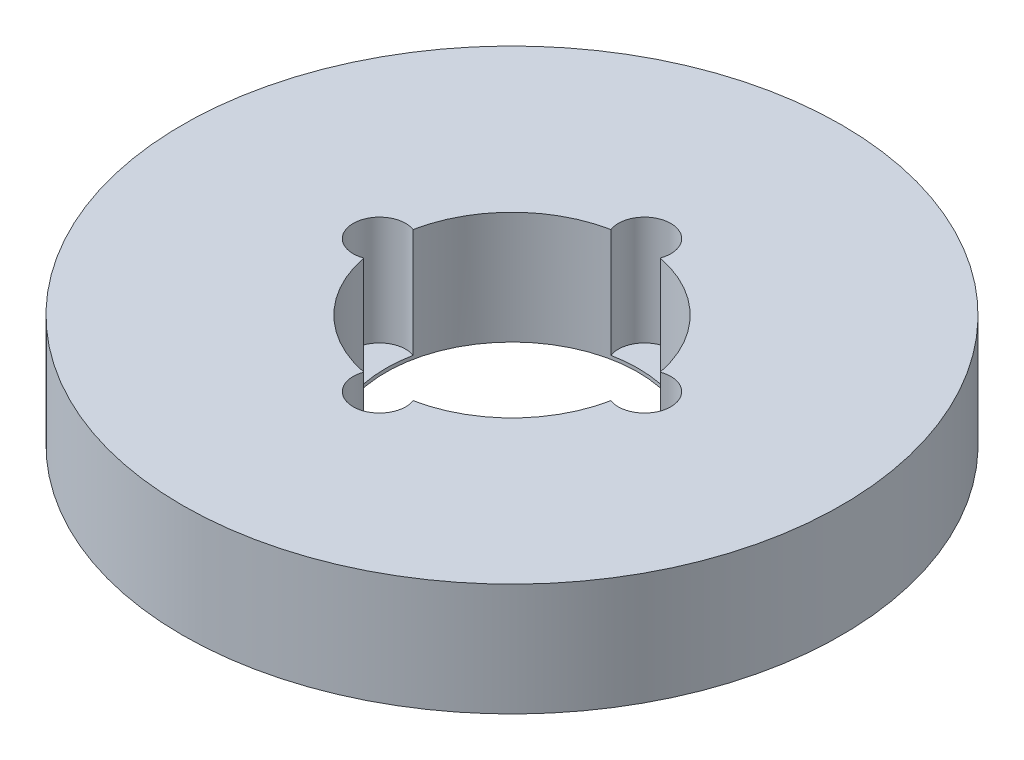
ISO-10303-21;
HEADER;
FILE_DESCRIPTION(('STEP AP214'),'2;1');
FILE_NAME('part.step','',(''),(''),'','','');
FILE_SCHEMA(('AUTOMOTIVE_DESIGN { 1 0 10303 214 1 1 1 1 }'));
ENDSEC;
DATA;
#1=APPLICATION_CONTEXT('core data for automotive mechanical design processes');
#2=APPLICATION_PROTOCOL_DEFINITION('international standard','automotive_design',2000,#1);
#3=PRODUCT_CONTEXT('',#1,'mechanical');
#4=PRODUCT('Part','Part','',(#3));
#5=PRODUCT_RELATED_PRODUCT_CATEGORY('part','',(#4));
#6=PRODUCT_DEFINITION_FORMATION('','',#4);
#7=PRODUCT_DEFINITION_CONTEXT('part definition',#1,'design');
#8=PRODUCT_DEFINITION('design','',#6,#7);
#9=PRODUCT_DEFINITION_SHAPE('','',#8);
#10=(LENGTH_UNIT() NAMED_UNIT(*) SI_UNIT(.MILLI.,.METRE.));
#11=(NAMED_UNIT(*) PLANE_ANGLE_UNIT() SI_UNIT($,.RADIAN.));
#12=(NAMED_UNIT(*) SI_UNIT($,.STERADIAN.) SOLID_ANGLE_UNIT());
#13=UNCERTAINTY_MEASURE_WITH_UNIT(LENGTH_MEASURE(1.E-05),#10,'distance_accuracy_value','');
#14=(GEOMETRIC_REPRESENTATION_CONTEXT(3) GLOBAL_UNCERTAINTY_ASSIGNED_CONTEXT((#13)) GLOBAL_UNIT_ASSIGNED_CONTEXT((#10,
#11,#12)) REPRESENTATION_CONTEXT('',''));
#15=CARTESIAN_POINT('',(0.,0.,0.));
#16=DIRECTION('',(0.,0.,1.));
#17=DIRECTION('',(1.,0.,0.));
#18=AXIS2_PLACEMENT_3D('',#15,#16,#17);
#19=CARTESIAN_POINT('',(0.,29.,0.));
#20=DIRECTION('',(0.,-1.,0.));
#21=DIRECTION('',(0.,0.,-1.));
#22=AXIS2_PLACEMENT_3D('',#19,#20,#21);
#23=CYLINDRICAL_SURFACE('',#22,85.);
#24=CARTESIAN_POINT('',(0.,29.,0.));
#25=DIRECTION('',(0.,1.,0.));
#26=DIRECTION('',(0.,0.,1.));
#27=AXIS2_PLACEMENT_3D('',#24,#25,#26);
#28=CIRCLE('',#27,85.);
#29=CARTESIAN_POINT('',(0.,29.,-85.));
#30=VERTEX_POINT('',#29);
#31=EDGE_CURVE('E145',#30,#30,#28,.T.);
#32=CARTESIAN_POINT('',(0.,0.,0.));
#33=DIRECTION('',(0.,1.,0.));
#34=DIRECTION('',(0.,0.,1.));
#35=AXIS2_PLACEMENT_3D('',#32,#33,#34);
#36=CIRCLE('',#35,85.);
#37=CARTESIAN_POINT('',(0.,0.,-85.));
#38=VERTEX_POINT('',#37);
#39=EDGE_CURVE('E143',#38,#38,#36,.T.);
#40=CARTESIAN_POINT('',(0.,29.,-85.));
#41=CARTESIAN_POINT('',(0.,28.6979166666667,-85.));
#42=CARTESIAN_POINT('',(0.,28.3958333333333,-85.));
#43=CARTESIAN_POINT('',(0.,27.7916666666667,-85.));
#44=CARTESIAN_POINT('',(0.,27.4895833333333,-85.));
#45=CARTESIAN_POINT('',(0.,26.8854166666667,-85.));
#46=CARTESIAN_POINT('',(0.,26.5833333333333,-85.));
#47=CARTESIAN_POINT('',(0.,25.9791666666667,-85.));
#48=CARTESIAN_POINT('',(0.,25.6770833333333,-85.));
#49=CARTESIAN_POINT('',(0.,25.0729166666667,-85.));
#50=CARTESIAN_POINT('',(0.,24.7708333333333,-85.));
#51=CARTESIAN_POINT('',(0.,24.1666666666667,-85.));
#52=CARTESIAN_POINT('',(0.,23.8645833333333,-85.));
#53=CARTESIAN_POINT('',(0.,23.2604166666667,-85.));
#54=CARTESIAN_POINT('',(0.,22.9583333333333,-85.));
#55=CARTESIAN_POINT('',(0.,22.3541666666667,-85.));
#56=CARTESIAN_POINT('',(0.,22.0520833333333,-85.));
#57=CARTESIAN_POINT('',(0.,21.4479166666667,-85.));
#58=CARTESIAN_POINT('',(0.,21.1458333333333,-85.));
#59=CARTESIAN_POINT('',(0.,20.5416666666667,-85.));
#60=CARTESIAN_POINT('',(0.,20.2395833333333,-85.));
#61=CARTESIAN_POINT('',(0.,19.6354166666667,-85.));
#62=CARTESIAN_POINT('',(0.,19.3333333333333,-85.));
#63=CARTESIAN_POINT('',(0.,18.7291666666667,-85.));
#64=CARTESIAN_POINT('',(0.,18.4270833333333,-85.));
#65=CARTESIAN_POINT('',(0.,17.8229166666667,-85.));
#66=CARTESIAN_POINT('',(0.,17.5208333333333,-85.));
#67=CARTESIAN_POINT('',(0.,16.9166666666667,-85.));
#68=CARTESIAN_POINT('',(0.,16.6145833333333,-85.));
#69=CARTESIAN_POINT('',(0.,16.0104166666667,-85.));
#70=CARTESIAN_POINT('',(0.,15.7083333333333,-85.));
#71=CARTESIAN_POINT('',(0.,15.1041666666667,-85.));
#72=CARTESIAN_POINT('',(0.,14.8020833333333,-85.));
#73=CARTESIAN_POINT('',(0.,14.1979166666667,-85.));
#74=CARTESIAN_POINT('',(0.,13.8958333333333,-85.));
#75=CARTESIAN_POINT('',(0.,13.2916666666667,-85.));
#76=CARTESIAN_POINT('',(0.,12.9895833333333,-85.));
#77=CARTESIAN_POINT('',(0.,12.3854166666667,-85.));
#78=CARTESIAN_POINT('',(0.,12.0833333333333,-85.));
#79=CARTESIAN_POINT('',(0.,11.4791666666667,-85.));
#80=CARTESIAN_POINT('',(0.,11.1770833333333,-85.));
#81=CARTESIAN_POINT('',(0.,10.5729166666667,-85.));
#82=CARTESIAN_POINT('',(0.,10.2708333333333,-85.));
#83=CARTESIAN_POINT('',(0.,9.66666666666667,-85.));
#84=CARTESIAN_POINT('',(0.,9.36458333333333,-85.));
#85=CARTESIAN_POINT('',(0.,8.76041666666667,-85.));
#86=CARTESIAN_POINT('',(0.,8.45833333333333,-85.));
#87=CARTESIAN_POINT('',(0.,7.85416666666667,-85.));
#88=CARTESIAN_POINT('',(0.,7.55208333333333,-85.));
#89=CARTESIAN_POINT('',(0.,6.94791666666667,-85.));
#90=CARTESIAN_POINT('',(0.,6.64583333333333,-85.));
#91=CARTESIAN_POINT('',(0.,6.04166666666667,-85.));
#92=CARTESIAN_POINT('',(0.,5.73958333333333,-85.));
#93=CARTESIAN_POINT('',(0.,5.13541666666667,-85.));
#94=CARTESIAN_POINT('',(0.,4.83333333333333,-85.));
#95=CARTESIAN_POINT('',(0.,4.22916666666667,-85.));
#96=CARTESIAN_POINT('',(0.,3.92708333333333,-85.));
#97=CARTESIAN_POINT('',(0.,3.32291666666667,-85.));
#98=CARTESIAN_POINT('',(0.,3.02083333333333,-85.));
#99=CARTESIAN_POINT('',(0.,2.41666666666667,-85.));
#100=CARTESIAN_POINT('',(0.,2.11458333333333,-85.));
#101=CARTESIAN_POINT('',(0.,1.51041666666667,-85.));
#102=CARTESIAN_POINT('',(0.,1.20833333333333,-85.));
#103=CARTESIAN_POINT('',(0.,0.604166666666667,-85.));
#104=CARTESIAN_POINT('',(0.,0.302083333333333,-85.));
#105=CARTESIAN_POINT('',(0.,0.,-85.));
#106=B_SPLINE_CURVE_WITH_KNOTS('',3,(#40,#41,#42,#43,#44,#45,#46,#47,#48,#49,#50,#51,#52,#53,
#54,#55,#56,#57,#58,#59,#60,#61,#62,#63,#64,#65,#66,#67,#68,#69,#70,#71,#72,#73,#74,#75,#76,#77,
#78,#79,#80,#81,#82,#83,#84,#85,#86,#87,#88,#89,#90,#91,#92,#93,#94,#95,#96,#97,#98,#99,#100,
#101,#102,#103,#104,#105),.UNSPECIFIED.,.F.,.F.,(4,2,2,2,2,2,2,2,2,2,2,2,2,2,2,2,2,2,2,2,2,2,2,
2,2,2,2,2,2,2,2,2,4),(0.,0.906249999999997,1.8125,2.71875,3.625,4.53125,5.4375,6.34375,7.25,
8.15625,9.0625,9.96875,10.875,11.78125,12.6875,13.59375,14.5,15.40625,16.3125,17.21875,18.125,
19.03125,19.9375,20.84375,21.75,22.65625,23.5625,24.46875,25.375,26.28125,27.1875,28.09375,29.),.UNSPECIFIED.);
#107=EDGE_CURVE('BSEAM39',#30,#38,#106,.T.);
#108=ORIENTED_EDGE('',*,*,#31,.F.);
#109=ORIENTED_EDGE('',*,*,#39,.T.);
#110=ORIENTED_EDGE('',*,*,#107,.T.);
#111=ORIENTED_EDGE('',*,*,#107,.F.);
#112=EDGE_LOOP('',(#108,#110,#109,#111));
#113=FACE_BOUND('',#112,.T.);
#114=ADVANCED_FACE('F39',(#113),#23,.T.);
#115=CARTESIAN_POINT('',(0.,29.,0.));
#116=DIRECTION('',(0.,1.,0.));
#117=DIRECTION('',(0.,0.,1.));
#118=AXIS2_PLACEMENT_3D('',#115,#116,#117);
#119=PLANE('',#118);
#120=CARTESIAN_POINT('',(1.19339958026891E-13,29.,34.1803224606188));
#121=DIRECTION('',(0.,1.,0.));
#122=DIRECTION('',(1.,0.,0.));
#123=AXIS2_PLACEMENT_3D('',#120,#121,#122);
#124=CIRCLE('',#123,6.78343065768431);
#125=CARTESIAN_POINT('',(-6.3772204408346,29.,31.8681825564151));
#126=VERTEX_POINT('',#125);
#127=CARTESIAN_POINT('',(6.37722044083483,29.,31.8681825564151));
#128=VERTEX_POINT('',#127);
#129=EDGE_CURVE('E152',#126,#128,#124,.T.);
#130=ORIENTED_EDGE('',*,*,#129,.F.);
#131=CARTESIAN_POINT('',(0.,29.,0.));
#132=DIRECTION('',(0.,1.,0.));
#133=DIRECTION('',(0.,0.,1.));
#134=AXIS2_PLACEMENT_3D('',#131,#132,#133);
#135=CIRCLE('',#134,32.5);
#136=CARTESIAN_POINT('',(-31.8681825564151,29.,6.37722044083472));
#137=VERTEX_POINT('',#136);
#138=EDGE_CURVE('E133',#137,#126,#135,.T.);
#139=ORIENTED_EDGE('',*,*,#138,.F.);
#140=CARTESIAN_POINT('',(-34.1803224606188,29.,0.));
#141=DIRECTION('',(0.,1.,0.));
#142=DIRECTION('',(0.,0.,1.));
#143=AXIS2_PLACEMENT_3D('',#140,#141,#142);
#144=CIRCLE('',#143,6.78343065768431);
#145=CARTESIAN_POINT('',(-31.8681825564151,29.,-6.37722044083472));
#146=VERTEX_POINT('',#145);
#147=EDGE_CURVE('E128',#146,#137,#144,.T.);
#148=ORIENTED_EDGE('',*,*,#147,.F.);
#149=CARTESIAN_POINT('',(-6.37722044083505,29.,-31.868182556415));
#150=VERTEX_POINT('',#149);
#151=EDGE_CURVE('E121',#150,#146,#135,.T.);
#152=ORIENTED_EDGE('',*,*,#151,.F.);
#153=CARTESIAN_POINT('',(-3.58019874080674E-13,29.,-34.1803224606188));
#154=DIRECTION('',(0.,1.,0.));
#155=DIRECTION('',(-1.,0.,0.));
#156=AXIS2_PLACEMENT_3D('',#153,#154,#155);
#157=CIRCLE('',#156,6.78343065768431);
#158=CARTESIAN_POINT('',(6.37722044083438,29.,-31.8681825564152));
#159=VERTEX_POINT('',#158);
#160=EDGE_CURVE('E105',#159,#150,#157,.T.);
#161=ORIENTED_EDGE('',*,*,#160,.F.);
#162=CARTESIAN_POINT('',(31.8681825564151,29.,-6.37722044083472));
#163=VERTEX_POINT('',#162);
#164=EDGE_CURVE('E131',#163,#159,#135,.T.);
#165=ORIENTED_EDGE('',*,*,#164,.F.);
#166=CARTESIAN_POINT('',(34.1803224606188,29.,0.));
#167=DIRECTION('',(0.,1.,0.));
#168=DIRECTION('',(0.,0.,-1.));
#169=AXIS2_PLACEMENT_3D('',#166,#167,#168);
#170=CIRCLE('',#169,6.78343065768431);
#171=CARTESIAN_POINT('',(31.8681825564151,29.,6.37722044083472));
#172=VERTEX_POINT('',#171);
#173=EDGE_CURVE('E154',#172,#163,#170,.T.);
#174=ORIENTED_EDGE('',*,*,#173,.F.);
#175=EDGE_CURVE('E134',#128,#172,#135,.T.);
#176=ORIENTED_EDGE('',*,*,#175,.F.);
#177=EDGE_LOOP('',(#130,#139,#148,#152,#161,#165,#174,#176));
#178=FACE_BOUND('',#177,.T.);
#179=ORIENTED_EDGE('',*,*,#31,.T.);
#180=EDGE_LOOP('',(#179));
#181=FACE_BOUND('',#180,.T.);
#182=ADVANCED_FACE('F130',(#178,#181),#119,.T.);
#183=CARTESIAN_POINT('',(0.,0.,0.));
#184=DIRECTION('',(0.,1.,0.));
#185=DIRECTION('',(0.,0.,1.));
#186=AXIS2_PLACEMENT_3D('',#183,#184,#185);
#187=PLANE('',#186);
#188=CARTESIAN_POINT('',(0.,0.,0.));
#189=DIRECTION('',(0.,1.,0.));
#190=DIRECTION('',(0.,0.,1.));
#191=AXIS2_PLACEMENT_3D('',#188,#189,#190);
#192=CIRCLE('',#191,32.5);
#193=CARTESIAN_POINT('',(0.,0.,32.5));
#194=VERTEX_POINT('',#193);
#195=EDGE_CURVE('E135',#194,#194,#192,.T.);
#196=ORIENTED_EDGE('',*,*,#195,.T.);
#197=EDGE_LOOP('',(#196));
#198=FACE_BOUND('',#197,.T.);
#199=ORIENTED_EDGE('',*,*,#39,.F.);
#200=EDGE_LOOP('',(#199));
#201=FACE_BOUND('',#200,.T.);
#202=ADVANCED_FACE('F195',(#198,#201),#187,.F.);
#203=CARTESIAN_POINT('',(0.,29.,0.));
#204=DIRECTION('',(0.,-1.,0.));
#205=DIRECTION('',(0.,0.,-1.));
#206=AXIS2_PLACEMENT_3D('',#203,#204,#205);
#207=CYLINDRICAL_SURFACE('',#206,32.5);
#208=DIRECTION('',(0.,1.,0.));
#209=VECTOR('',#208,1.);
#210=CARTESIAN_POINT('',(-6.3772204408346,14.9445900321365,31.8681825564151));
#211=LINE('',#210,#209);
#212=CARTESIAN_POINT('',(-6.3772204408346,0.889180064273069,31.8681825564151));
#213=VERTEX_POINT('',#212);
#214=EDGE_CURVE('E11',#213,#126,#211,.T.);
#215=ORIENTED_EDGE('',*,*,#214,.F.);
#216=CARTESIAN_POINT('',(0.,0.889180064273069,0.));
#217=DIRECTION('',(0.,1.,0.));
#218=DIRECTION('',(0.,0.,1.));
#219=AXIS2_PLACEMENT_3D('',#216,#217,#218);
#220=CIRCLE('',#219,32.5);
#221=CARTESIAN_POINT('',(6.37722044083483,0.889180064273069,31.8681825564151));
#222=VERTEX_POINT('',#221);
#223=EDGE_CURVE('E169',#213,#222,#220,.T.);
#224=ORIENTED_EDGE('',*,*,#223,.T.);
#225=DIRECTION('',(0.,1.,0.));
#226=VECTOR('',#225,1.);
#227=CARTESIAN_POINT('',(6.37722044083483,14.9445900321365,31.8681825564151));
#228=LINE('',#227,#226);
#229=EDGE_CURVE('E46',#128,#222,#228,.F.);
#230=ORIENTED_EDGE('',*,*,#229,.F.);
#231=ORIENTED_EDGE('',*,*,#175,.T.);
#232=DIRECTION('',(0.,1.,0.));
#233=VECTOR('',#232,1.);
#234=CARTESIAN_POINT('',(31.8681825564151,14.9445900321365,6.37722044083472));
#235=LINE('',#234,#233);
#236=CARTESIAN_POINT('',(31.8681825564151,0.889180064273069,6.37722044083472));
#237=VERTEX_POINT('',#236);
#238=EDGE_CURVE('E151',#237,#172,#235,.T.);
#239=ORIENTED_EDGE('',*,*,#238,.F.);
#240=CARTESIAN_POINT('',(0.,0.889180064273069,0.));
#241=DIRECTION('',(0.,1.,0.));
#242=DIRECTION('',(0.,0.,1.));
#243=AXIS2_PLACEMENT_3D('',#240,#241,#242);
#244=CIRCLE('',#243,32.5);
#245=CARTESIAN_POINT('',(31.8681825564151,0.889180064273069,-6.37722044083472));
#246=VERTEX_POINT('',#245);
#247=EDGE_CURVE('E173',#237,#246,#244,.T.);
#248=ORIENTED_EDGE('',*,*,#247,.T.);
#249=DIRECTION('',(0.,1.,0.));
#250=VECTOR('',#249,1.);
#251=CARTESIAN_POINT('',(31.8681825564151,14.9445900321365,-6.37722044083472));
#252=LINE('',#251,#250);
#253=EDGE_CURVE('E168',#163,#246,#252,.F.);
#254=ORIENTED_EDGE('',*,*,#253,.F.);
#255=ORIENTED_EDGE('',*,*,#164,.T.);
#256=DIRECTION('',(0.,1.,0.));
#257=VECTOR('',#256,1.);
#258=CARTESIAN_POINT('',(6.37722044083438,14.9445900321365,-31.8681825564152));
#259=LINE('',#258,#257);
#260=CARTESIAN_POINT('',(6.37722044083438,0.889180064273069,-31.8681825564152));
#261=VERTEX_POINT('',#260);
#262=EDGE_CURVE('E108',#261,#159,#259,.T.);
#263=ORIENTED_EDGE('',*,*,#262,.F.);
#264=CARTESIAN_POINT('',(0.,0.889180064273069,0.));
#265=DIRECTION('',(0.,1.,0.));
#266=DIRECTION('',(0.,0.,1.));
#267=AXIS2_PLACEMENT_3D('',#264,#265,#266);
#268=CIRCLE('',#267,32.5);
#269=CARTESIAN_POINT('',(-6.37722044083505,0.889180064273069,-31.868182556415));
#270=VERTEX_POINT('',#269);
#271=EDGE_CURVE('E122',#261,#270,#268,.T.);
#272=ORIENTED_EDGE('',*,*,#271,.T.);
#273=DIRECTION('',(0.,1.,0.));
#274=VECTOR('',#273,1.);
#275=CARTESIAN_POINT('',(-6.37722044083505,14.9445900321365,-31.868182556415));
#276=LINE('',#275,#274);
#277=EDGE_CURVE('E106',#150,#270,#276,.F.);
#278=ORIENTED_EDGE('',*,*,#277,.F.);
#279=ORIENTED_EDGE('',*,*,#151,.T.);
#280=DIRECTION('',(0.,1.,0.));
#281=VECTOR('',#280,1.);
#282=CARTESIAN_POINT('',(-31.8681825564151,14.9445900321365,-6.37722044083472));
#283=LINE('',#282,#281);
#284=CARTESIAN_POINT('',(-31.8681825564151,0.889180064273069,-6.37722044083472));
#285=VERTEX_POINT('',#284);
#286=EDGE_CURVE('E177',#285,#146,#283,.T.);
#287=ORIENTED_EDGE('',*,*,#286,.F.);
#288=CARTESIAN_POINT('',(0.,0.889180064273069,0.));
#289=DIRECTION('',(0.,1.,0.));
#290=DIRECTION('',(0.,0.,1.));
#291=AXIS2_PLACEMENT_3D('',#288,#289,#290);
#292=CIRCLE('',#291,32.5);
#293=CARTESIAN_POINT('',(-31.8681825564151,0.889180064273069,6.37722044083472));
#294=VERTEX_POINT('',#293);
#295=EDGE_CURVE('E185',#285,#294,#292,.T.);
#296=ORIENTED_EDGE('',*,*,#295,.T.);
#297=DIRECTION('',(0.,1.,0.));
#298=VECTOR('',#297,1.);
#299=CARTESIAN_POINT('',(-31.8681825564151,14.9445900321365,6.37722044083472));
#300=LINE('',#299,#298);
#301=EDGE_CURVE('E179',#137,#294,#300,.F.);
#302=ORIENTED_EDGE('',*,*,#301,.F.);
#303=ORIENTED_EDGE('',*,*,#138,.T.);
#304=EDGE_LOOP('',(#215,#224,#230,#231,#239,#248,#254,#255,#263,#272,#278,#279,#287,#296,#302,#303));
#305=FACE_BOUND('',#304,.T.);
#306=ORIENTED_EDGE('',*,*,#195,.F.);
#307=EDGE_LOOP('',(#306));
#308=FACE_BOUND('',#307,.T.);
#309=ADVANCED_FACE('F117',(#305,#308),#207,.F.);
#310=CARTESIAN_POINT('',(-34.1803224606188,0.889180064273069,0.));
#311=DIRECTION('',(0.,1.,0.));
#312=DIRECTION('',(0.,0.,1.));
#313=AXIS2_PLACEMENT_3D('',#310,#311,#312);
#314=CYLINDRICAL_SURFACE('',#313,6.78343065768431);
#315=ORIENTED_EDGE('',*,*,#286,.T.);
#316=ORIENTED_EDGE('',*,*,#147,.T.);
#317=ORIENTED_EDGE('',*,*,#301,.T.);
#318=CARTESIAN_POINT('',(-34.1803224606188,0.889180064273069,0.));
#319=DIRECTION('',(0.,1.,0.));
#320=DIRECTION('',(0.,0.,1.));
#321=AXIS2_PLACEMENT_3D('',#318,#319,#320);
#322=CIRCLE('',#321,6.78343065768431);
#323=EDGE_CURVE('E140',#285,#294,#322,.T.);
#324=ORIENTED_EDGE('',*,*,#323,.F.);
#325=EDGE_LOOP('',(#315,#316,#317,#324));
#326=FACE_BOUND('',#325,.T.);
#327=ADVANCED_FACE('F200',(#326),#314,.F.);
#328=CARTESIAN_POINT('',(-34.1803224606188,0.889180064273069,0.));
#329=DIRECTION('',(0.,1.,0.));
#330=DIRECTION('',(0.,0.,1.));
#331=AXIS2_PLACEMENT_3D('',#328,#329,#330);
#332=PLANE('',#331);
#333=ORIENTED_EDGE('',*,*,#323,.T.);
#334=ORIENTED_EDGE('',*,*,#295,.F.);
#335=EDGE_LOOP('',(#333,#334));
#336=FACE_BOUND('',#335,.T.);
#337=ADVANCED_FACE('F202',(#336),#332,.T.);
#338=CARTESIAN_POINT('',(-3.58019874080674E-13,0.889180064273069,-34.1803224606188));
#339=DIRECTION('',(0.,1.,0.));
#340=DIRECTION('',(0.,0.,1.));
#341=AXIS2_PLACEMENT_3D('',#338,#339,#340);
#342=CYLINDRICAL_SURFACE('',#341,6.78343065768431);
#343=ORIENTED_EDGE('',*,*,#262,.T.);
#344=ORIENTED_EDGE('',*,*,#160,.T.);
#345=ORIENTED_EDGE('',*,*,#277,.T.);
#346=CARTESIAN_POINT('',(-3.58019874080674E-13,0.889180064273069,-34.1803224606188));
#347=DIRECTION('',(0.,1.,0.));
#348=DIRECTION('',(-1.,0.,0.));
#349=AXIS2_PLACEMENT_3D('',#346,#347,#348);
#350=CIRCLE('',#349,6.78343065768431);
#351=EDGE_CURVE('E111',#261,#270,#350,.T.);
#352=ORIENTED_EDGE('',*,*,#351,.F.);
#353=EDGE_LOOP('',(#343,#344,#345,#352));
#354=FACE_BOUND('',#353,.T.);
#355=ADVANCED_FACE('F102',(#354),#342,.F.);
#356=CARTESIAN_POINT('',(-3.58019874080674E-13,0.889180064273069,-34.1803224606188));
#357=DIRECTION('',(0.,1.,0.));
#358=DIRECTION('',(-1.,0.,0.));
#359=AXIS2_PLACEMENT_3D('',#356,#357,#358);
#360=PLANE('',#359);
#361=ORIENTED_EDGE('',*,*,#351,.T.);
#362=ORIENTED_EDGE('',*,*,#271,.F.);
#363=EDGE_LOOP('',(#361,#362));
#364=FACE_BOUND('',#363,.T.);
#365=ADVANCED_FACE('F211',(#364),#360,.T.);
#366=CARTESIAN_POINT('',(34.1803224606188,0.889180064273069,0.));
#367=DIRECTION('',(0.,1.,0.));
#368=DIRECTION('',(0.,0.,1.));
#369=AXIS2_PLACEMENT_3D('',#366,#367,#368);
#370=CYLINDRICAL_SURFACE('',#369,6.78343065768431);
#371=ORIENTED_EDGE('',*,*,#238,.T.);
#372=ORIENTED_EDGE('',*,*,#173,.T.);
#373=ORIENTED_EDGE('',*,*,#253,.T.);
#374=CARTESIAN_POINT('',(34.1803224606188,0.889180064273069,0.));
#375=DIRECTION('',(0.,1.,0.));
#376=DIRECTION('',(0.,0.,-1.));
#377=AXIS2_PLACEMENT_3D('',#374,#375,#376);
#378=CIRCLE('',#377,6.78343065768431);
#379=EDGE_CURVE('E56',#237,#246,#378,.T.);
#380=ORIENTED_EDGE('',*,*,#379,.F.);
#381=EDGE_LOOP('',(#371,#372,#373,#380));
#382=FACE_BOUND('',#381,.T.);
#383=ADVANCED_FACE('F212',(#382),#370,.F.);
#384=CARTESIAN_POINT('',(34.1803224606188,0.889180064273069,0.));
#385=DIRECTION('',(0.,1.,0.));
#386=DIRECTION('',(0.,0.,-1.));
#387=AXIS2_PLACEMENT_3D('',#384,#385,#386);
#388=PLANE('',#387);
#389=ORIENTED_EDGE('',*,*,#379,.T.);
#390=ORIENTED_EDGE('',*,*,#247,.F.);
#391=EDGE_LOOP('',(#389,#390));
#392=FACE_BOUND('',#391,.T.);
#393=ADVANCED_FACE('F217',(#392),#388,.T.);
#394=CARTESIAN_POINT('',(1.19339958026891E-13,0.889180064273069,34.1803224606188));
#395=DIRECTION('',(0.,1.,0.));
#396=DIRECTION('',(0.,0.,1.));
#397=AXIS2_PLACEMENT_3D('',#394,#395,#396);
#398=CYLINDRICAL_SURFACE('',#397,6.78343065768431);
#399=ORIENTED_EDGE('',*,*,#214,.T.);
#400=ORIENTED_EDGE('',*,*,#129,.T.);
#401=ORIENTED_EDGE('',*,*,#229,.T.);
#402=CARTESIAN_POINT('',(1.19339958026891E-13,0.889180064273069,34.1803224606188));
#403=DIRECTION('',(0.,1.,0.));
#404=DIRECTION('',(1.,0.,0.));
#405=AXIS2_PLACEMENT_3D('',#402,#403,#404);
#406=CIRCLE('',#405,6.78343065768431);
#407=EDGE_CURVE('E55',#213,#222,#406,.T.);
#408=ORIENTED_EDGE('',*,*,#407,.F.);
#409=EDGE_LOOP('',(#399,#400,#401,#408));
#410=FACE_BOUND('',#409,.T.);
#411=ADVANCED_FACE('F170',(#410),#398,.F.);
#412=CARTESIAN_POINT('',(1.19339958026891E-13,0.889180064273069,34.1803224606188));
#413=DIRECTION('',(0.,1.,0.));
#414=DIRECTION('',(1.,0.,0.));
#415=AXIS2_PLACEMENT_3D('',#412,#413,#414);
#416=PLANE('',#415);
#417=ORIENTED_EDGE('',*,*,#407,.T.);
#418=ORIENTED_EDGE('',*,*,#223,.F.);
#419=EDGE_LOOP('',(#417,#418));
#420=FACE_BOUND('',#419,.T.);
#421=ADVANCED_FACE('F224',(#420),#416,.T.);
#422=CLOSED_SHELL('',(#114,#182,#202,#309,#327,#337,#355,#365,#383,#393,#411,#421));
#423=MANIFOLD_SOLID_BREP('B2',#422);
#424=ADVANCED_BREP_SHAPE_REPRESENTATION('',(#18,#423),#14);
#425=SHAPE_DEFINITION_REPRESENTATION(#9,#424);
ENDSEC;
END-ISO-10303-21;
